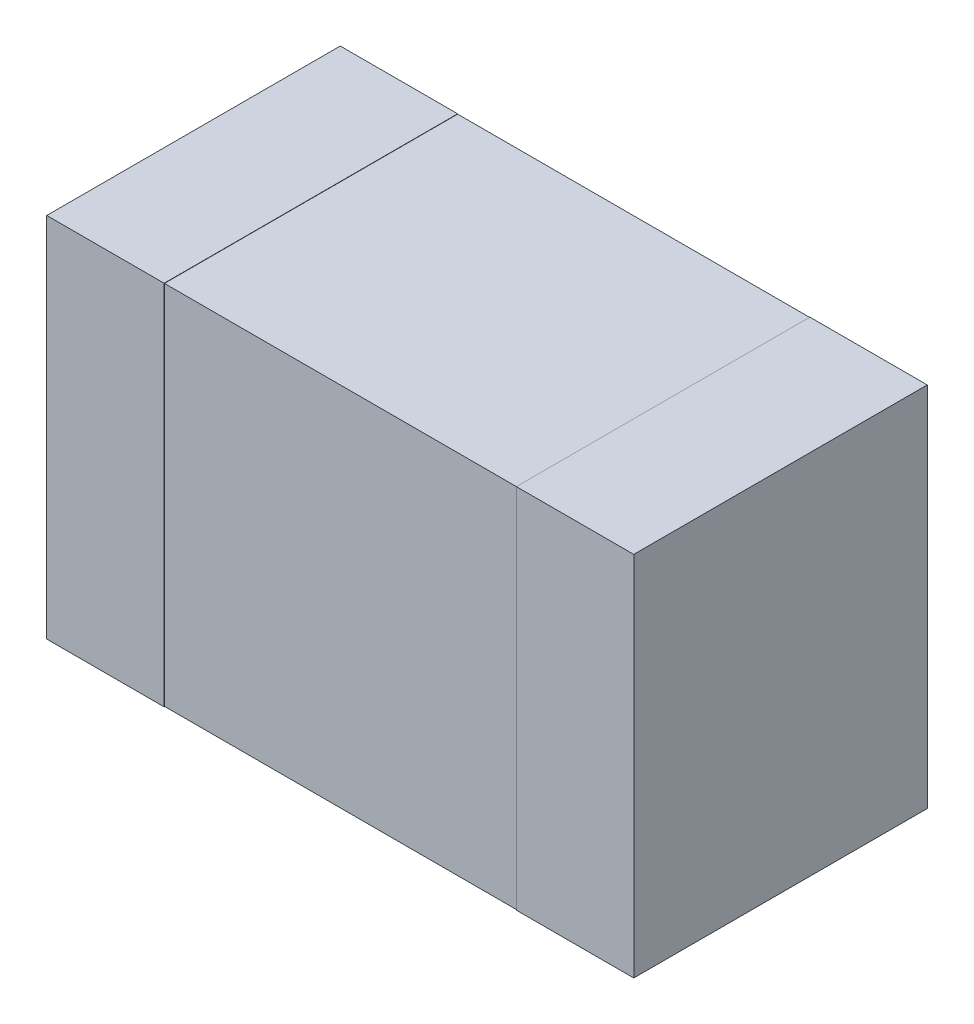
ISO-10303-21;
HEADER;
FILE_DESCRIPTION(('STEP AP214'),'2;1');
FILE_NAME('part.step','',(''),(''),'','','');
FILE_SCHEMA(('AUTOMOTIVE_DESIGN { 1 0 10303 214 1 1 1 1 }'));
ENDSEC;
DATA;
#1=APPLICATION_CONTEXT('core data for automotive mechanical design processes');
#2=APPLICATION_PROTOCOL_DEFINITION('international standard','automotive_design',2000,#1);
#3=PRODUCT_CONTEXT('',#1,'mechanical');
#4=PRODUCT('Part','Part','',(#3));
#5=PRODUCT_RELATED_PRODUCT_CATEGORY('part','',(#4));
#6=PRODUCT_DEFINITION_FORMATION('','',#4);
#7=PRODUCT_DEFINITION_CONTEXT('part definition',#1,'design');
#8=PRODUCT_DEFINITION('design','',#6,#7);
#9=PRODUCT_DEFINITION_SHAPE('','',#8);
#10=(LENGTH_UNIT() NAMED_UNIT(*) SI_UNIT(.MILLI.,.METRE.));
#11=(NAMED_UNIT(*) PLANE_ANGLE_UNIT() SI_UNIT($,.RADIAN.));
#12=(NAMED_UNIT(*) SI_UNIT($,.STERADIAN.) SOLID_ANGLE_UNIT());
#13=UNCERTAINTY_MEASURE_WITH_UNIT(LENGTH_MEASURE(1.E-05),#10,'distance_accuracy_value','');
#14=(GEOMETRIC_REPRESENTATION_CONTEXT(3) GLOBAL_UNCERTAINTY_ASSIGNED_CONTEXT((#13)) GLOBAL_UNIT_ASSIGNED_CONTEXT((#10,
#11,#12)) REPRESENTATION_CONTEXT('',''));
#15=CARTESIAN_POINT('',(0.,0.,0.));
#16=DIRECTION('',(0.,0.,1.));
#17=DIRECTION('',(1.,0.,0.));
#18=AXIS2_PLACEMENT_3D('',#15,#16,#17);
#19=CARTESIAN_POINT('',(0.,0.,1.));
#20=DIRECTION('',(0.,0.,1.));
#21=DIRECTION('',(1.,0.,0.));
#22=AXIS2_PLACEMENT_3D('',#19,#20,#21);
#23=PLANE('',#22);
#24=DIRECTION('',(0.,1.,0.));
#25=VECTOR('',#24,1.);
#26=CARTESIAN_POINT('',(1.,0.625,1.));
#27=LINE('',#26,#25);
#28=CARTESIAN_POINT('',(1.,-0.625,1.));
#29=VERTEX_POINT('',#28);
#30=CARTESIAN_POINT('',(1.,0.625,1.));
#31=VERTEX_POINT('',#30);
#32=EDGE_CURVE('E224',#29,#31,#27,.T.);
#33=ORIENTED_EDGE('',*,*,#32,.T.);
#34=DIRECTION('',(1.,0.,0.));
#35=VECTOR('',#34,1.);
#36=CARTESIAN_POINT('',(-1.,0.625,1.));
#37=LINE('',#36,#35);
#38=CARTESIAN_POINT('',(0.6,0.625,1.));
#39=VERTEX_POINT('',#38);
#40=EDGE_CURVE('E218',#31,#39,#37,.F.);
#41=ORIENTED_EDGE('',*,*,#40,.T.);
#42=DIRECTION('',(0.,1.,0.));
#43=VECTOR('',#42,1.);
#44=CARTESIAN_POINT('',(0.6,0.625,1.));
#45=LINE('',#44,#43);
#46=CARTESIAN_POINT('',(0.6,-0.625,1.));
#47=VERTEX_POINT('',#46);
#48=EDGE_CURVE('E212',#39,#47,#45,.F.);
#49=ORIENTED_EDGE('',*,*,#48,.T.);
#50=DIRECTION('',(1.,0.,0.));
#51=VECTOR('',#50,1.);
#52=CARTESIAN_POINT('',(-1.,-0.625,1.));
#53=LINE('',#52,#51);
#54=EDGE_CURVE('E94',#47,#29,#53,.T.);
#55=ORIENTED_EDGE('',*,*,#54,.T.);
#56=EDGE_LOOP('',(#33,#41,#49,#55));
#57=FACE_BOUND('',#56,.T.);
#58=ADVANCED_FACE('F17',(#57),#23,.T.);
#59=CARTESIAN_POINT('',(0.,0.,1.));
#60=DIRECTION('',(0.,0.,1.));
#61=DIRECTION('',(1.,0.,0.));
#62=AXIS2_PLACEMENT_3D('',#59,#60,#61);
#63=PLANE('',#62);
#64=DIRECTION('',(1.,0.,0.));
#65=VECTOR('',#64,1.);
#66=CARTESIAN_POINT('',(-1.,0.625,1.));
#67=LINE('',#66,#65);
#68=CARTESIAN_POINT('',(-0.6,0.625,1.));
#69=VERTEX_POINT('',#68);
#70=CARTESIAN_POINT('',(-1.,0.625,1.));
#71=VERTEX_POINT('',#70);
#72=EDGE_CURVE('E108',#69,#71,#67,.F.);
#73=ORIENTED_EDGE('',*,*,#72,.T.);
#74=DIRECTION('',(0.,1.,0.));
#75=VECTOR('',#74,1.);
#76=CARTESIAN_POINT('',(-1.,0.625,1.));
#77=LINE('',#76,#75);
#78=CARTESIAN_POINT('',(-1.,-0.625,1.));
#79=VERTEX_POINT('',#78);
#80=EDGE_CURVE('E137',#71,#79,#77,.F.);
#81=ORIENTED_EDGE('',*,*,#80,.T.);
#82=DIRECTION('',(1.,0.,0.));
#83=VECTOR('',#82,1.);
#84=CARTESIAN_POINT('',(-1.,-0.625,1.));
#85=LINE('',#84,#83);
#86=CARTESIAN_POINT('',(-0.6,-0.625,1.));
#87=VERTEX_POINT('',#86);
#88=EDGE_CURVE('E120',#79,#87,#85,.T.);
#89=ORIENTED_EDGE('',*,*,#88,.T.);
#90=DIRECTION('',(0.,1.,0.));
#91=VECTOR('',#90,1.);
#92=CARTESIAN_POINT('',(-0.6,0.625,1.));
#93=LINE('',#92,#91);
#94=EDGE_CURVE('E185',#87,#69,#93,.T.);
#95=ORIENTED_EDGE('',*,*,#94,.T.);
#96=EDGE_LOOP('',(#73,#81,#89,#95));
#97=FACE_BOUND('',#96,.T.);
#98=ADVANCED_FACE('F289',(#97),#63,.T.);
#99=CARTESIAN_POINT('',(0.6,-0.625,0.999));
#100=DIRECTION('',(0.,0.,-1.));
#101=DIRECTION('',(-1.,0.,0.));
#102=AXIS2_PLACEMENT_3D('',#99,#100,#101);
#103=PLANE('',#102);
#104=DIRECTION('',(1.,0.,0.));
#105=VECTOR('',#104,1.);
#106=CARTESIAN_POINT('',(0.6,0.624,0.999));
#107=LINE('',#106,#105);
#108=CARTESIAN_POINT('',(0.6,0.624,0.999));
#109=VERTEX_POINT('',#108);
#110=CARTESIAN_POINT('',(-0.6,0.624,0.999));
#111=VERTEX_POINT('',#110);
#112=EDGE_CURVE('E115',#109,#111,#107,.F.);
#113=ORIENTED_EDGE('',*,*,#112,.T.);
#114=DIRECTION('',(0.,1.,0.));
#115=VECTOR('',#114,1.);
#116=CARTESIAN_POINT('',(-0.6,0.625,0.999));
#117=LINE('',#116,#115);
#118=CARTESIAN_POINT('',(-0.6,-0.624,0.999));
#119=VERTEX_POINT('',#118);
#120=EDGE_CURVE('E191',#111,#119,#117,.F.);
#121=ORIENTED_EDGE('',*,*,#120,.T.);
#122=DIRECTION('',(1.,0.,0.));
#123=VECTOR('',#122,1.);
#124=CARTESIAN_POINT('',(0.6,-0.624,0.999));
#125=LINE('',#124,#123);
#126=CARTESIAN_POINT('',(0.6,-0.624,0.999));
#127=VERTEX_POINT('',#126);
#128=EDGE_CURVE('E177',#119,#127,#125,.T.);
#129=ORIENTED_EDGE('',*,*,#128,.T.);
#130=DIRECTION('',(0.,1.,0.));
#131=VECTOR('',#130,1.);
#132=CARTESIAN_POINT('',(0.6,0.625,0.999));
#133=LINE('',#132,#131);
#134=EDGE_CURVE('E69',#127,#109,#133,.T.);
#135=ORIENTED_EDGE('',*,*,#134,.T.);
#136=EDGE_LOOP('',(#113,#121,#129,#135));
#137=FACE_BOUND('',#136,.T.);
#138=ADVANCED_FACE('F294',(#137),#103,.F.);
#139=CARTESIAN_POINT('',(-1.,-0.625,1.));
#140=DIRECTION('',(0.,1.,0.));
#141=DIRECTION('',(0.,0.,1.));
#142=AXIS2_PLACEMENT_3D('',#139,#140,#141);
#143=PLANE('',#142);
#144=DIRECTION('',(0.,0.,-1.));
#145=VECTOR('',#144,1.);
#146=CARTESIAN_POINT('',(0.6,-0.625,1.));
#147=LINE('',#146,#145);
#148=CARTESIAN_POINT('',(0.6,-0.625,0.));
#149=VERTEX_POINT('',#148);
#150=EDGE_CURVE('E210',#47,#149,#147,.T.);
#151=ORIENTED_EDGE('',*,*,#150,.T.);
#152=DIRECTION('',(1.,0.,0.));
#153=VECTOR('',#152,1.);
#154=CARTESIAN_POINT('',(0.,-0.625,0.));
#155=LINE('',#154,#153);
#156=CARTESIAN_POINT('',(1.,-0.625,0.));
#157=VERTEX_POINT('',#156);
#158=EDGE_CURVE('E171',#149,#157,#155,.T.);
#159=ORIENTED_EDGE('',*,*,#158,.T.);
#160=DIRECTION('',(0.,0.,1.));
#161=VECTOR('',#160,1.);
#162=CARTESIAN_POINT('',(1.,-0.625,1.));
#163=LINE('',#162,#161);
#164=EDGE_CURVE('E231',#157,#29,#163,.T.);
#165=ORIENTED_EDGE('',*,*,#164,.T.);
#166=ORIENTED_EDGE('',*,*,#54,.F.);
#167=EDGE_LOOP('',(#151,#159,#165,#166));
#168=FACE_BOUND('',#167,.T.);
#169=ADVANCED_FACE('F286',(#168),#143,.F.);
#170=CARTESIAN_POINT('',(1.,0.625,1.));
#171=DIRECTION('',(-1.,0.,0.));
#172=DIRECTION('',(0.,0.,1.));
#173=AXIS2_PLACEMENT_3D('',#170,#171,#172);
#174=PLANE('',#173);
#175=DIRECTION('',(0.,0.,-1.));
#176=VECTOR('',#175,1.);
#177=CARTESIAN_POINT('',(1.,0.625,1.));
#178=LINE('',#177,#176);
#179=CARTESIAN_POINT('',(1.,0.625,0.));
#180=VERTEX_POINT('',#179);
#181=EDGE_CURVE('E221',#180,#31,#178,.F.);
#182=ORIENTED_EDGE('',*,*,#181,.T.);
#183=ORIENTED_EDGE('',*,*,#32,.F.);
#184=ORIENTED_EDGE('',*,*,#164,.F.);
#185=DIRECTION('',(0.,1.,0.));
#186=VECTOR('',#185,1.);
#187=CARTESIAN_POINT('',(1.,0.,0.));
#188=LINE('',#187,#186);
#189=EDGE_CURVE('E168',#157,#180,#188,.T.);
#190=ORIENTED_EDGE('',*,*,#189,.T.);
#191=EDGE_LOOP('',(#182,#183,#184,#190));
#192=FACE_BOUND('',#191,.T.);
#193=ADVANCED_FACE('F285',(#192),#174,.F.);
#194=CARTESIAN_POINT('',(-1.,0.625,1.));
#195=DIRECTION('',(0.,-1.,0.));
#196=DIRECTION('',(0.,0.,-1.));
#197=AXIS2_PLACEMENT_3D('',#194,#195,#196);
#198=PLANE('',#197);
#199=DIRECTION('',(0.,0.,-1.));
#200=VECTOR('',#199,1.);
#201=CARTESIAN_POINT('',(0.6,0.625,1.));
#202=LINE('',#201,#200);
#203=CARTESIAN_POINT('',(0.6,0.625,0.));
#204=VERTEX_POINT('',#203);
#205=EDGE_CURVE('E215',#204,#39,#202,.F.);
#206=ORIENTED_EDGE('',*,*,#205,.T.);
#207=ORIENTED_EDGE('',*,*,#40,.F.);
#208=ORIENTED_EDGE('',*,*,#181,.F.);
#209=DIRECTION('',(1.,0.,0.));
#210=VECTOR('',#209,1.);
#211=CARTESIAN_POINT('',(0.,0.625,0.));
#212=LINE('',#211,#210);
#213=EDGE_CURVE('E165',#180,#204,#212,.F.);
#214=ORIENTED_EDGE('',*,*,#213,.T.);
#215=EDGE_LOOP('',(#206,#207,#208,#214));
#216=FACE_BOUND('',#215,.T.);
#217=ADVANCED_FACE('F281',(#216),#198,.F.);
#218=CARTESIAN_POINT('',(0.6,0.625,1.));
#219=DIRECTION('',(1.,0.,0.));
#220=DIRECTION('',(0.,0.,-1.));
#221=AXIS2_PLACEMENT_3D('',#218,#219,#220);
#222=PLANE('',#221);
#223=DIRECTION('',(0.,0.,-1.));
#224=VECTOR('',#223,1.);
#225=CARTESIAN_POINT('',(0.6,0.624,1.));
#226=LINE('',#225,#224);
#227=CARTESIAN_POINT('',(0.6,0.624,0.));
#228=VERTEX_POINT('',#227);
#229=EDGE_CURVE('E206',#228,#109,#226,.F.);
#230=ORIENTED_EDGE('',*,*,#229,.T.);
#231=ORIENTED_EDGE('',*,*,#134,.F.);
#232=DIRECTION('',(0.,0.,1.));
#233=VECTOR('',#232,1.);
#234=CARTESIAN_POINT('',(0.6,-0.624,1.));
#235=LINE('',#234,#233);
#236=CARTESIAN_POINT('',(0.6,-0.624,0.));
#237=VERTEX_POINT('',#236);
#238=EDGE_CURVE('E180',#127,#237,#235,.F.);
#239=ORIENTED_EDGE('',*,*,#238,.T.);
#240=DIRECTION('',(0.,1.,0.));
#241=VECTOR('',#240,1.);
#242=CARTESIAN_POINT('',(0.6,0.625,0.));
#243=LINE('',#242,#241);
#244=EDGE_CURVE('E20',#237,#149,#243,.F.);
#245=ORIENTED_EDGE('',*,*,#244,.T.);
#246=ORIENTED_EDGE('',*,*,#150,.F.);
#247=ORIENTED_EDGE('',*,*,#48,.F.);
#248=ORIENTED_EDGE('',*,*,#205,.F.);
#249=DIRECTION('',(0.,1.,0.));
#250=VECTOR('',#249,1.);
#251=CARTESIAN_POINT('',(0.6,0.625,0.));
#252=LINE('',#251,#250);
#253=EDGE_CURVE('E164',#204,#228,#252,.F.);
#254=ORIENTED_EDGE('',*,*,#253,.T.);
#255=EDGE_LOOP('',(#230,#231,#239,#245,#246,#247,#248,#254));
#256=FACE_BOUND('',#255,.T.);
#257=ADVANCED_FACE('F275',(#256),#222,.F.);
#258=CARTESIAN_POINT('',(0.6,0.624,1.));
#259=DIRECTION('',(0.,-1.,0.));
#260=DIRECTION('',(0.,0.,-1.));
#261=AXIS2_PLACEMENT_3D('',#258,#259,#260);
#262=PLANE('',#261);
#263=ORIENTED_EDGE('',*,*,#112,.F.);
#264=ORIENTED_EDGE('',*,*,#229,.F.);
#265=DIRECTION('',(1.,0.,0.));
#266=VECTOR('',#265,1.);
#267=CARTESIAN_POINT('',(0.,0.624,0.));
#268=LINE('',#267,#266);
#269=CARTESIAN_POINT('',(-0.6,0.624,0.));
#270=VERTEX_POINT('',#269);
#271=EDGE_CURVE('E154',#228,#270,#268,.F.);
#272=ORIENTED_EDGE('',*,*,#271,.T.);
#273=DIRECTION('',(0.,0.,1.));
#274=VECTOR('',#273,1.);
#275=CARTESIAN_POINT('',(-0.6,0.624,1.));
#276=LINE('',#275,#274);
#277=EDGE_CURVE('E194',#270,#111,#276,.T.);
#278=ORIENTED_EDGE('',*,*,#277,.T.);
#279=EDGE_LOOP('',(#263,#264,#272,#278));
#280=FACE_BOUND('',#279,.T.);
#281=ADVANCED_FACE('F314',(#280),#262,.F.);
#282=CARTESIAN_POINT('',(-1.,0.625,1.));
#283=DIRECTION('',(0.,-1.,0.));
#284=DIRECTION('',(0.,0.,-1.));
#285=AXIS2_PLACEMENT_3D('',#282,#283,#284);
#286=PLANE('',#285);
#287=DIRECTION('',(0.,0.,1.));
#288=VECTOR('',#287,1.);
#289=CARTESIAN_POINT('',(-0.6,0.625,1.));
#290=LINE('',#289,#288);
#291=CARTESIAN_POINT('',(-0.6,0.625,0.));
#292=VERTEX_POINT('',#291);
#293=EDGE_CURVE('E151',#69,#292,#290,.F.);
#294=ORIENTED_EDGE('',*,*,#293,.T.);
#295=DIRECTION('',(1.,0.,0.));
#296=VECTOR('',#295,1.);
#297=CARTESIAN_POINT('',(0.,0.625,0.));
#298=LINE('',#297,#296);
#299=CARTESIAN_POINT('',(-1.,0.625,0.));
#300=VERTEX_POINT('',#299);
#301=EDGE_CURVE('E145',#292,#300,#298,.F.);
#302=ORIENTED_EDGE('',*,*,#301,.T.);
#303=DIRECTION('',(0.,0.,-1.));
#304=VECTOR('',#303,1.);
#305=CARTESIAN_POINT('',(-1.,0.625,1.));
#306=LINE('',#305,#304);
#307=EDGE_CURVE('E133',#300,#71,#306,.F.);
#308=ORIENTED_EDGE('',*,*,#307,.T.);
#309=ORIENTED_EDGE('',*,*,#72,.F.);
#310=EDGE_LOOP('',(#294,#302,#308,#309));
#311=FACE_BOUND('',#310,.T.);
#312=ADVANCED_FACE('F149',(#311),#286,.F.);
#313=CARTESIAN_POINT('',(-1.,0.625,1.));
#314=DIRECTION('',(1.,0.,0.));
#315=DIRECTION('',(0.,0.,-1.));
#316=AXIS2_PLACEMENT_3D('',#313,#314,#315);
#317=PLANE('',#316);
#318=DIRECTION('',(0.,0.,1.));
#319=VECTOR('',#318,1.);
#320=CARTESIAN_POINT('',(-1.,-0.625,1.));
#321=LINE('',#320,#319);
#322=CARTESIAN_POINT('',(-1.,-0.625,0.));
#323=VERTEX_POINT('',#322);
#324=EDGE_CURVE('E127',#323,#79,#321,.T.);
#325=ORIENTED_EDGE('',*,*,#324,.T.);
#326=ORIENTED_EDGE('',*,*,#80,.F.);
#327=ORIENTED_EDGE('',*,*,#307,.F.);
#328=DIRECTION('',(0.,1.,0.));
#329=VECTOR('',#328,1.);
#330=CARTESIAN_POINT('',(-1.,0.,0.));
#331=LINE('',#330,#329);
#332=EDGE_CURVE('E136',#300,#323,#331,.F.);
#333=ORIENTED_EDGE('',*,*,#332,.T.);
#334=EDGE_LOOP('',(#325,#326,#327,#333));
#335=FACE_BOUND('',#334,.T.);
#336=ADVANCED_FACE('F135',(#335),#317,.F.);
#337=CARTESIAN_POINT('',(-1.,-0.625,1.));
#338=DIRECTION('',(0.,1.,0.));
#339=DIRECTION('',(0.,0.,1.));
#340=AXIS2_PLACEMENT_3D('',#337,#338,#339);
#341=PLANE('',#340);
#342=DIRECTION('',(0.,0.,1.));
#343=VECTOR('',#342,1.);
#344=CARTESIAN_POINT('',(-0.6,-0.625,1.));
#345=LINE('',#344,#343);
#346=CARTESIAN_POINT('',(-0.6,-0.625,0.));
#347=VERTEX_POINT('',#346);
#348=EDGE_CURVE('E188',#347,#87,#345,.T.);
#349=ORIENTED_EDGE('',*,*,#348,.T.);
#350=ORIENTED_EDGE('',*,*,#88,.F.);
#351=ORIENTED_EDGE('',*,*,#324,.F.);
#352=DIRECTION('',(1.,0.,0.));
#353=VECTOR('',#352,1.);
#354=CARTESIAN_POINT('',(0.,-0.625,0.));
#355=LINE('',#354,#353);
#356=EDGE_CURVE('E147',#323,#347,#355,.T.);
#357=ORIENTED_EDGE('',*,*,#356,.T.);
#358=EDGE_LOOP('',(#349,#350,#351,#357));
#359=FACE_BOUND('',#358,.T.);
#360=ADVANCED_FACE('F306',(#359),#341,.F.);
#361=CARTESIAN_POINT('',(-0.6,0.625,1.));
#362=DIRECTION('',(-1.,0.,0.));
#363=DIRECTION('',(0.,0.,1.));
#364=AXIS2_PLACEMENT_3D('',#361,#362,#363);
#365=PLANE('',#364);
#366=ORIENTED_EDGE('',*,*,#293,.F.);
#367=ORIENTED_EDGE('',*,*,#94,.F.);
#368=ORIENTED_EDGE('',*,*,#348,.F.);
#369=DIRECTION('',(0.,1.,0.));
#370=VECTOR('',#369,1.);
#371=CARTESIAN_POINT('',(-0.6,0.625,0.));
#372=LINE('',#371,#370);
#373=CARTESIAN_POINT('',(-0.6,-0.624,0.));
#374=VERTEX_POINT('',#373);
#375=EDGE_CURVE('E26',#347,#374,#372,.T.);
#376=ORIENTED_EDGE('',*,*,#375,.T.);
#377=DIRECTION('',(0.,0.,1.));
#378=VECTOR('',#377,1.);
#379=CARTESIAN_POINT('',(-0.6,-0.624,1.));
#380=LINE('',#379,#378);
#381=EDGE_CURVE('E34',#374,#119,#380,.T.);
#382=ORIENTED_EDGE('',*,*,#381,.T.);
#383=ORIENTED_EDGE('',*,*,#120,.F.);
#384=ORIENTED_EDGE('',*,*,#277,.F.);
#385=DIRECTION('',(0.,1.,0.));
#386=VECTOR('',#385,1.);
#387=CARTESIAN_POINT('',(-0.6,0.625,0.));
#388=LINE('',#387,#386);
#389=EDGE_CURVE('E152',#270,#292,#388,.T.);
#390=ORIENTED_EDGE('',*,*,#389,.T.);
#391=EDGE_LOOP('',(#366,#367,#368,#376,#382,#383,#384,#390));
#392=FACE_BOUND('',#391,.T.);
#393=ADVANCED_FACE('F301',(#392),#365,.F.);
#394=CARTESIAN_POINT('',(0.6,-0.624,1.));
#395=DIRECTION('',(0.,1.,0.));
#396=DIRECTION('',(0.,0.,1.));
#397=AXIS2_PLACEMENT_3D('',#394,#395,#396);
#398=PLANE('',#397);
#399=ORIENTED_EDGE('',*,*,#128,.F.);
#400=ORIENTED_EDGE('',*,*,#381,.F.);
#401=DIRECTION('',(1.,0.,0.));
#402=VECTOR('',#401,1.);
#403=CARTESIAN_POINT('',(0.,-0.624,0.));
#404=LINE('',#403,#402);
#405=EDGE_CURVE('E11',#374,#237,#404,.T.);
#406=ORIENTED_EDGE('',*,*,#405,.T.);
#407=ORIENTED_EDGE('',*,*,#238,.F.);
#408=EDGE_LOOP('',(#399,#400,#406,#407));
#409=FACE_BOUND('',#408,.T.);
#410=ADVANCED_FACE('F296',(#409),#398,.F.);
#411=CARTESIAN_POINT('',(0.,0.,0.));
#412=DIRECTION('',(0.,0.,1.));
#413=DIRECTION('',(1.,0.,0.));
#414=AXIS2_PLACEMENT_3D('',#411,#412,#413);
#415=PLANE('',#414);
#416=ORIENTED_EDGE('',*,*,#375,.F.);
#417=ORIENTED_EDGE('',*,*,#356,.F.);
#418=ORIENTED_EDGE('',*,*,#332,.F.);
#419=ORIENTED_EDGE('',*,*,#301,.F.);
#420=ORIENTED_EDGE('',*,*,#389,.F.);
#421=ORIENTED_EDGE('',*,*,#271,.F.);
#422=ORIENTED_EDGE('',*,*,#253,.F.);
#423=ORIENTED_EDGE('',*,*,#213,.F.);
#424=ORIENTED_EDGE('',*,*,#189,.F.);
#425=ORIENTED_EDGE('',*,*,#158,.F.);
#426=ORIENTED_EDGE('',*,*,#244,.F.);
#427=ORIENTED_EDGE('',*,*,#405,.F.);
#428=EDGE_LOOP('',(#416,#417,#418,#419,#420,#421,#422,#423,#424,#425,#426,#427));
#429=FACE_BOUND('',#428,.T.);
#430=ADVANCED_FACE('F143',(#429),#415,.F.);
#431=CLOSED_SHELL('',(#58,#98,#138,#169,#193,#217,#257,#281,#312,#336,#360,#393,#410,#430));
#432=MANIFOLD_SOLID_BREP('B1',#431);
#433=ADVANCED_BREP_SHAPE_REPRESENTATION('',(#18,#432),#14);
#434=SHAPE_DEFINITION_REPRESENTATION(#9,#433);
ENDSEC;
END-ISO-10303-21;
